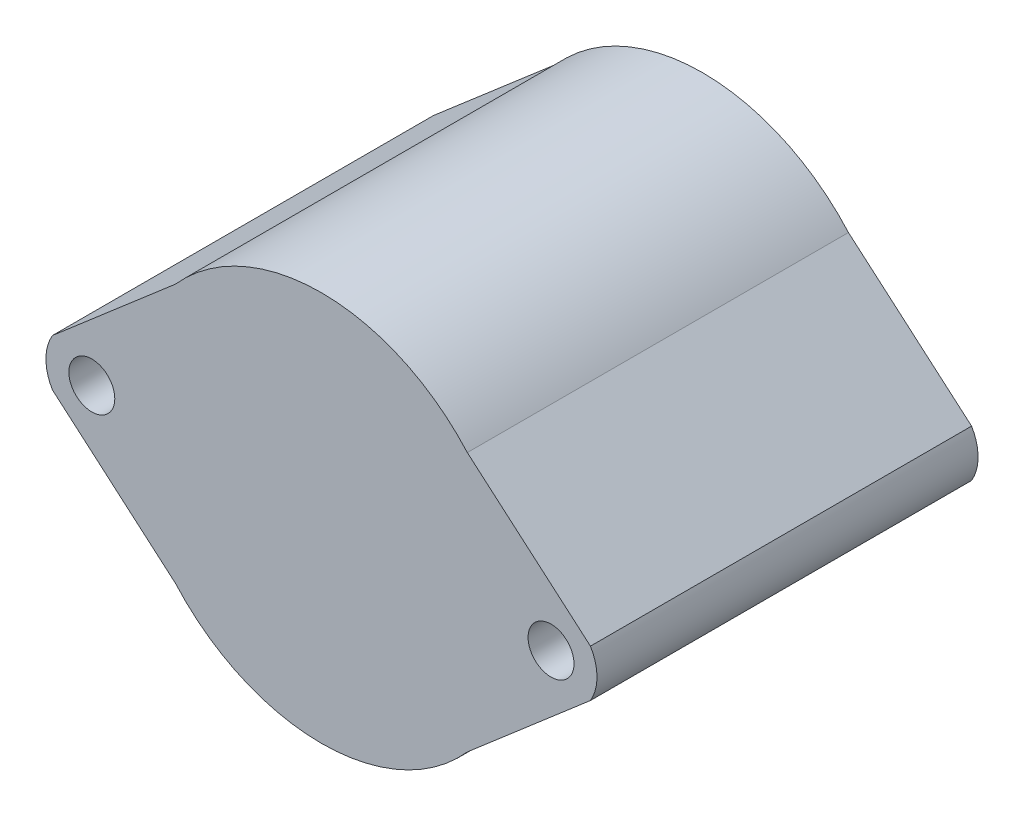
ISO-10303-21;
HEADER;
FILE_DESCRIPTION(('STEP AP214'),'2;1');
FILE_NAME('part.step','',(''),(''),'','','');
FILE_SCHEMA(('AUTOMOTIVE_DESIGN { 1 0 10303 214 1 1 1 1 }'));
ENDSEC;
DATA;
#1=APPLICATION_CONTEXT('core data for automotive mechanical design processes');
#2=APPLICATION_PROTOCOL_DEFINITION('international standard','automotive_design',2000,#1);
#3=PRODUCT_CONTEXT('',#1,'mechanical');
#4=PRODUCT('Part','Part','',(#3));
#5=PRODUCT_RELATED_PRODUCT_CATEGORY('part','',(#4));
#6=PRODUCT_DEFINITION_FORMATION('','',#4);
#7=PRODUCT_DEFINITION_CONTEXT('part definition',#1,'design');
#8=PRODUCT_DEFINITION('design','',#6,#7);
#9=PRODUCT_DEFINITION_SHAPE('','',#8);
#10=(LENGTH_UNIT() NAMED_UNIT(*) SI_UNIT(.MILLI.,.METRE.));
#11=(NAMED_UNIT(*) PLANE_ANGLE_UNIT() SI_UNIT($,.RADIAN.));
#12=(NAMED_UNIT(*) SI_UNIT($,.STERADIAN.) SOLID_ANGLE_UNIT());
#13=UNCERTAINTY_MEASURE_WITH_UNIT(LENGTH_MEASURE(1.E-05),#10,'distance_accuracy_value','');
#14=(GEOMETRIC_REPRESENTATION_CONTEXT(3) GLOBAL_UNCERTAINTY_ASSIGNED_CONTEXT((#13)) GLOBAL_UNIT_ASSIGNED_CONTEXT((#10,
#11,#12)) REPRESENTATION_CONTEXT('',''));
#15=CARTESIAN_POINT('',(0.,0.,0.));
#16=DIRECTION('',(0.,0.,1.));
#17=DIRECTION('',(1.,0.,0.));
#18=AXIS2_PLACEMENT_3D('',#15,#16,#17);
#19=CARTESIAN_POINT('',(20.,0.,33.2));
#20=DIRECTION('',(0.,0.,1.));
#21=DIRECTION('',(1.,0.,0.));
#22=AXIS2_PLACEMENT_3D('',#19,#20,#21);
#23=PLANE('',#22);
#24=CARTESIAN_POINT('',(-20.,0.,33.2));
#25=DIRECTION('',(0.,0.,1.));
#26=DIRECTION('',(1.,0.,0.));
#27=AXIS2_PLACEMENT_3D('',#24,#25,#26);
#28=CIRCLE('',#27,2.);
#29=CARTESIAN_POINT('',(-18.,0.,33.2));
#30=VERTEX_POINT('',#29);
#31=EDGE_CURVE('E134',#30,#30,#28,.T.);
#32=ORIENTED_EDGE('',*,*,#31,.F.);
#33=EDGE_LOOP('',(#32));
#34=FACE_BOUND('',#33,.T.);
#35=CARTESIAN_POINT('',(20.,0.,33.2));
#36=DIRECTION('',(0.,0.,1.));
#37=DIRECTION('',(1.,0.,0.));
#38=AXIS2_PLACEMENT_3D('',#35,#36,#37);
#39=CIRCLE('',#38,4.);
#40=CARTESIAN_POINT('',(23.433804338793,-2.05158177094813,33.2));
#41=VERTEX_POINT('',#40);
#42=CARTESIAN_POINT('',(23.433804338793,2.05158177094813,33.2));
#43=VERTEX_POINT('',#42);
#44=EDGE_CURVE('E145',#41,#43,#39,.T.);
#45=ORIENTED_EDGE('',*,*,#44,.T.);
#46=DIRECTION('',(-0.757630891805894,0.652683255324822,0.));
#47=VECTOR('',#46,1.);
#48=CARTESIAN_POINT('',(23.433804338793,2.05158177094813,33.2));
#49=LINE('',#48,#47);
#50=CARTESIAN_POINT('',(12.7089428610678,11.2908268675998,33.2));
#51=VERTEX_POINT('',#50);
#52=EDGE_CURVE('E93',#43,#51,#49,.T.);
#53=ORIENTED_EDGE('',*,*,#52,.T.);
#54=CARTESIAN_POINT('',(0.,0.,33.2));
#55=DIRECTION('',(0.,0.,1.));
#56=DIRECTION('',(1.,0.,0.));
#57=AXIS2_PLACEMENT_3D('',#54,#55,#56);
#58=CIRCLE('',#57,17.);
#59=CARTESIAN_POINT('',(-12.7089428610678,11.2908268675998,33.2));
#60=VERTEX_POINT('',#59);
#61=EDGE_CURVE('E160',#51,#60,#58,.T.);
#62=ORIENTED_EDGE('',*,*,#61,.T.);
#63=DIRECTION('',(-0.757630891805894,-0.652683255324822,0.));
#64=VECTOR('',#63,1.);
#65=CARTESIAN_POINT('',(-23.433804338793,2.05158177094813,33.2));
#66=LINE('',#65,#64);
#67=CARTESIAN_POINT('',(-23.433804338793,2.05158177094813,33.2));
#68=VERTEX_POINT('',#67);
#69=EDGE_CURVE('E173',#60,#68,#66,.T.);
#70=ORIENTED_EDGE('',*,*,#69,.T.);
#71=CARTESIAN_POINT('',(-20.,0.,33.2));
#72=DIRECTION('',(0.,0.,1.));
#73=DIRECTION('',(1.,0.,0.));
#74=AXIS2_PLACEMENT_3D('',#71,#72,#73);
#75=CIRCLE('',#74,4.);
#76=CARTESIAN_POINT('',(-23.433804338793,-2.05158177094813,33.2));
#77=VERTEX_POINT('',#76);
#78=EDGE_CURVE('E112',#68,#77,#75,.T.);
#79=ORIENTED_EDGE('',*,*,#78,.T.);
#80=DIRECTION('',(0.757630891805894,-0.652683255324822,0.));
#81=VECTOR('',#80,1.);
#82=CARTESIAN_POINT('',(-23.433804338793,-2.05158177094813,33.2));
#83=LINE('',#82,#81);
#84=CARTESIAN_POINT('',(-12.7089428610678,-11.2908268675998,33.2));
#85=VERTEX_POINT('',#84);
#86=EDGE_CURVE('E106',#77,#85,#83,.T.);
#87=ORIENTED_EDGE('',*,*,#86,.T.);
#88=CARTESIAN_POINT('',(0.,0.,33.2));
#89=DIRECTION('',(0.,0.,1.));
#90=DIRECTION('',(1.,0.,0.));
#91=AXIS2_PLACEMENT_3D('',#88,#89,#90);
#92=CIRCLE('',#91,17.);
#93=CARTESIAN_POINT('',(12.7089428610678,-11.2908268675998,33.2));
#94=VERTEX_POINT('',#93);
#95=EDGE_CURVE('E110',#85,#94,#92,.T.);
#96=ORIENTED_EDGE('',*,*,#95,.T.);
#97=DIRECTION('',(0.757630891805894,0.652683255324822,0.));
#98=VECTOR('',#97,1.);
#99=CARTESIAN_POINT('',(23.433804338793,-2.05158177094813,33.2));
#100=LINE('',#99,#98);
#101=EDGE_CURVE('E50',#94,#41,#100,.T.);
#102=ORIENTED_EDGE('',*,*,#101,.T.);
#103=EDGE_LOOP('',(#45,#53,#62,#70,#79,#87,#96,#102));
#104=FACE_BOUND('',#103,.T.);
#105=CARTESIAN_POINT('',(20.,0.,33.2));
#106=DIRECTION('',(0.,0.,1.));
#107=DIRECTION('',(1.,0.,0.));
#108=AXIS2_PLACEMENT_3D('',#105,#106,#107);
#109=CIRCLE('',#108,2.);
#110=CARTESIAN_POINT('',(22.,0.,33.2));
#111=VERTEX_POINT('',#110);
#112=EDGE_CURVE('E182',#111,#111,#109,.T.);
#113=ORIENTED_EDGE('',*,*,#112,.F.);
#114=EDGE_LOOP('',(#113));
#115=FACE_BOUND('',#114,.T.);
#116=ADVANCED_FACE('F33',(#34,#104,#115),#23,.T.);
#117=CARTESIAN_POINT('',(20.,0.,0.));
#118=DIRECTION('',(0.,0.,1.));
#119=DIRECTION('',(1.,0.,0.));
#120=AXIS2_PLACEMENT_3D('',#117,#118,#119);
#121=PLANE('',#120);
#122=CARTESIAN_POINT('',(20.,0.,0.));
#123=DIRECTION('',(0.,0.,1.));
#124=DIRECTION('',(1.,0.,0.));
#125=AXIS2_PLACEMENT_3D('',#122,#123,#124);
#126=CIRCLE('',#125,4.);
#127=CARTESIAN_POINT('',(23.433804338793,-2.05158177094813,0.));
#128=VERTEX_POINT('',#127);
#129=CARTESIAN_POINT('',(23.433804338793,2.05158177094813,0.));
#130=VERTEX_POINT('',#129);
#131=EDGE_CURVE('E130',#128,#130,#126,.T.);
#132=ORIENTED_EDGE('',*,*,#131,.F.);
#133=DIRECTION('',(0.757630891805894,0.652683255324822,0.));
#134=VECTOR('',#133,1.);
#135=CARTESIAN_POINT('',(23.433804338793,-2.05158177094813,0.));
#136=LINE('',#135,#134);
#137=CARTESIAN_POINT('',(12.7089428610678,-11.2908268675998,0.));
#138=VERTEX_POINT('',#137);
#139=EDGE_CURVE('E85',#138,#128,#136,.T.);
#140=ORIENTED_EDGE('',*,*,#139,.F.);
#141=CARTESIAN_POINT('',(0.,0.,0.));
#142=DIRECTION('',(0.,0.,1.));
#143=DIRECTION('',(1.,0.,0.));
#144=AXIS2_PLACEMENT_3D('',#141,#142,#143);
#145=CIRCLE('',#144,17.);
#146=CARTESIAN_POINT('',(-12.7089428610678,-11.2908268675998,0.));
#147=VERTEX_POINT('',#146);
#148=EDGE_CURVE('E79',#147,#138,#145,.T.);
#149=ORIENTED_EDGE('',*,*,#148,.F.);
#150=DIRECTION('',(0.757630891805894,-0.652683255324822,0.));
#151=VECTOR('',#150,1.);
#152=CARTESIAN_POINT('',(-23.433804338793,-2.05158177094813,0.));
#153=LINE('',#152,#151);
#154=CARTESIAN_POINT('',(-23.433804338793,-2.05158177094813,0.));
#155=VERTEX_POINT('',#154);
#156=EDGE_CURVE('E120',#155,#147,#153,.T.);
#157=ORIENTED_EDGE('',*,*,#156,.F.);
#158=CARTESIAN_POINT('',(-20.,0.,0.));
#159=DIRECTION('',(0.,0.,1.));
#160=DIRECTION('',(1.,0.,0.));
#161=AXIS2_PLACEMENT_3D('',#158,#159,#160);
#162=CIRCLE('',#161,4.);
#163=CARTESIAN_POINT('',(-23.433804338793,2.05158177094813,0.));
#164=VERTEX_POINT('',#163);
#165=EDGE_CURVE('E140',#164,#155,#162,.T.);
#166=ORIENTED_EDGE('',*,*,#165,.F.);
#167=DIRECTION('',(-0.757630891805894,-0.652683255324822,0.));
#168=VECTOR('',#167,1.);
#169=CARTESIAN_POINT('',(-23.433804338793,2.05158177094813,0.));
#170=LINE('',#169,#168);
#171=CARTESIAN_POINT('',(-12.7089428610678,11.2908268675998,0.));
#172=VERTEX_POINT('',#171);
#173=EDGE_CURVE('E138',#172,#164,#170,.T.);
#174=ORIENTED_EDGE('',*,*,#173,.F.);
#175=CARTESIAN_POINT('',(0.,0.,0.));
#176=DIRECTION('',(0.,0.,1.));
#177=DIRECTION('',(1.,0.,0.));
#178=AXIS2_PLACEMENT_3D('',#175,#176,#177);
#179=CIRCLE('',#178,17.);
#180=CARTESIAN_POINT('',(12.7089428610678,11.2908268675998,0.));
#181=VERTEX_POINT('',#180);
#182=EDGE_CURVE('E136',#181,#172,#179,.T.);
#183=ORIENTED_EDGE('',*,*,#182,.F.);
#184=DIRECTION('',(-0.757630891805894,0.652683255324822,0.));
#185=VECTOR('',#184,1.);
#186=CARTESIAN_POINT('',(23.433804338793,2.05158177094813,0.));
#187=LINE('',#186,#185);
#188=EDGE_CURVE('E133',#130,#181,#187,.T.);
#189=ORIENTED_EDGE('',*,*,#188,.F.);
#190=EDGE_LOOP('',(#132,#140,#149,#157,#166,#174,#183,#189));
#191=FACE_BOUND('',#190,.T.);
#192=CARTESIAN_POINT('',(-20.,0.,0.));
#193=DIRECTION('',(0.,0.,1.));
#194=DIRECTION('',(1.,0.,0.));
#195=AXIS2_PLACEMENT_3D('',#192,#193,#194);
#196=CIRCLE('',#195,2.);
#197=CARTESIAN_POINT('',(-18.,0.,0.));
#198=VERTEX_POINT('',#197);
#199=EDGE_CURVE('E179',#198,#198,#196,.T.);
#200=ORIENTED_EDGE('',*,*,#199,.T.);
#201=EDGE_LOOP('',(#200));
#202=FACE_BOUND('',#201,.T.);
#203=CARTESIAN_POINT('',(20.,0.,0.));
#204=DIRECTION('',(0.,0.,1.));
#205=DIRECTION('',(1.,0.,0.));
#206=AXIS2_PLACEMENT_3D('',#203,#204,#205);
#207=CIRCLE('',#206,2.);
#208=CARTESIAN_POINT('',(22.,0.,0.));
#209=VERTEX_POINT('',#208);
#210=EDGE_CURVE('E185',#209,#209,#207,.T.);
#211=ORIENTED_EDGE('',*,*,#210,.T.);
#212=EDGE_LOOP('',(#211));
#213=FACE_BOUND('',#212,.T.);
#214=ADVANCED_FACE('F164',(#191,#202,#213),#121,.F.);
#215=CARTESIAN_POINT('',(20.,0.,33.2));
#216=DIRECTION('',(0.,0.,-1.));
#217=DIRECTION('',(-1.,0.,0.));
#218=AXIS2_PLACEMENT_3D('',#215,#216,#217);
#219=CYLINDRICAL_SURFACE('',#218,4.);
#220=ORIENTED_EDGE('',*,*,#131,.T.);
#221=DIRECTION('',(0.,0.,-1.));
#222=VECTOR('',#221,1.);
#223=CARTESIAN_POINT('',(23.433804338793,2.05158177094813,33.2));
#224=LINE('',#223,#222);
#225=EDGE_CURVE('E11',#43,#130,#224,.T.);
#226=ORIENTED_EDGE('',*,*,#225,.F.);
#227=ORIENTED_EDGE('',*,*,#44,.F.);
#228=DIRECTION('',(0.,0.,-1.));
#229=VECTOR('',#228,1.);
#230=CARTESIAN_POINT('',(23.433804338793,-2.05158177094813,33.2));
#231=LINE('',#230,#229);
#232=EDGE_CURVE('E126',#41,#128,#231,.T.);
#233=ORIENTED_EDGE('',*,*,#232,.T.);
#234=EDGE_LOOP('',(#220,#226,#227,#233));
#235=FACE_BOUND('',#234,.T.);
#236=ADVANCED_FACE('F35',(#235),#219,.T.);
#237=CARTESIAN_POINT('',(23.433804338793,2.05158177094813,33.2));
#238=DIRECTION('',(-0.652683255324821,-0.757630891805894,0.));
#239=DIRECTION('',(0.757630891805894,-0.652683255324822,0.));
#240=AXIS2_PLACEMENT_3D('',#237,#238,#239);
#241=PLANE('',#240);
#242=ORIENTED_EDGE('',*,*,#188,.T.);
#243=DIRECTION('',(0.,0.,-1.));
#244=VECTOR('',#243,1.);
#245=CARTESIAN_POINT('',(12.7089428610678,11.2908268675998,33.2));
#246=LINE('',#245,#244);
#247=EDGE_CURVE('E42',#51,#181,#246,.T.);
#248=ORIENTED_EDGE('',*,*,#247,.F.);
#249=ORIENTED_EDGE('',*,*,#52,.F.);
#250=ORIENTED_EDGE('',*,*,#225,.T.);
#251=EDGE_LOOP('',(#242,#248,#249,#250));
#252=FACE_BOUND('',#251,.T.);
#253=ADVANCED_FACE('F217',(#252),#241,.F.);
#254=CARTESIAN_POINT('',(0.,0.,33.2));
#255=DIRECTION('',(0.,0.,-1.));
#256=DIRECTION('',(-1.,0.,0.));
#257=AXIS2_PLACEMENT_3D('',#254,#255,#256);
#258=CYLINDRICAL_SURFACE('',#257,17.);
#259=ORIENTED_EDGE('',*,*,#182,.T.);
#260=DIRECTION('',(0.,0.,-1.));
#261=VECTOR('',#260,1.);
#262=CARTESIAN_POINT('',(-12.7089428610678,11.2908268675998,33.2));
#263=LINE('',#262,#261);
#264=EDGE_CURVE('E152',#60,#172,#263,.T.);
#265=ORIENTED_EDGE('',*,*,#264,.F.);
#266=ORIENTED_EDGE('',*,*,#61,.F.);
#267=ORIENTED_EDGE('',*,*,#247,.T.);
#268=EDGE_LOOP('',(#259,#265,#266,#267));
#269=FACE_BOUND('',#268,.T.);
#270=ADVANCED_FACE('F158',(#269),#258,.T.);
#271=CARTESIAN_POINT('',(-23.433804338793,2.05158177094813,33.2));
#272=DIRECTION('',(0.652683255324821,-0.757630891805894,0.));
#273=DIRECTION('',(0.757630891805894,0.652683255324822,0.));
#274=AXIS2_PLACEMENT_3D('',#271,#272,#273);
#275=PLANE('',#274);
#276=ORIENTED_EDGE('',*,*,#173,.T.);
#277=DIRECTION('',(0.,0.,-1.));
#278=VECTOR('',#277,1.);
#279=CARTESIAN_POINT('',(-23.433804338793,2.05158177094813,33.2));
#280=LINE('',#279,#278);
#281=EDGE_CURVE('E149',#68,#164,#280,.T.);
#282=ORIENTED_EDGE('',*,*,#281,.F.);
#283=ORIENTED_EDGE('',*,*,#69,.F.);
#284=ORIENTED_EDGE('',*,*,#264,.T.);
#285=EDGE_LOOP('',(#276,#282,#283,#284));
#286=FACE_BOUND('',#285,.T.);
#287=ADVANCED_FACE('F169',(#286),#275,.F.);
#288=CARTESIAN_POINT('',(-20.,0.,33.2));
#289=DIRECTION('',(0.,0.,-1.));
#290=DIRECTION('',(-1.,0.,0.));
#291=AXIS2_PLACEMENT_3D('',#288,#289,#290);
#292=CYLINDRICAL_SURFACE('',#291,4.);
#293=ORIENTED_EDGE('',*,*,#165,.T.);
#294=DIRECTION('',(0.,0.,-1.));
#295=VECTOR('',#294,1.);
#296=CARTESIAN_POINT('',(-23.433804338793,-2.05158177094813,33.2));
#297=LINE('',#296,#295);
#298=EDGE_CURVE('E121',#77,#155,#297,.T.);
#299=ORIENTED_EDGE('',*,*,#298,.F.);
#300=ORIENTED_EDGE('',*,*,#78,.F.);
#301=ORIENTED_EDGE('',*,*,#281,.T.);
#302=EDGE_LOOP('',(#293,#299,#300,#301));
#303=FACE_BOUND('',#302,.T.);
#304=ADVANCED_FACE('F172',(#303),#292,.T.);
#305=CARTESIAN_POINT('',(-23.433804338793,-2.05158177094813,33.2));
#306=DIRECTION('',(0.652683255324821,0.757630891805894,0.));
#307=DIRECTION('',(-0.757630891805894,0.652683255324822,0.));
#308=AXIS2_PLACEMENT_3D('',#305,#306,#307);
#309=PLANE('',#308);
#310=ORIENTED_EDGE('',*,*,#156,.T.);
#311=DIRECTION('',(0.,0.,-1.));
#312=VECTOR('',#311,1.);
#313=CARTESIAN_POINT('',(-12.7089428610678,-11.2908268675998,33.2));
#314=LINE('',#313,#312);
#315=EDGE_CURVE('E117',#85,#147,#314,.T.);
#316=ORIENTED_EDGE('',*,*,#315,.F.);
#317=ORIENTED_EDGE('',*,*,#86,.F.);
#318=ORIENTED_EDGE('',*,*,#298,.T.);
#319=EDGE_LOOP('',(#310,#316,#317,#318));
#320=FACE_BOUND('',#319,.T.);
#321=ADVANCED_FACE('F118',(#320),#309,.F.);
#322=CARTESIAN_POINT('',(0.,0.,33.2));
#323=DIRECTION('',(0.,0.,-1.));
#324=DIRECTION('',(-1.,0.,0.));
#325=AXIS2_PLACEMENT_3D('',#322,#323,#324);
#326=CYLINDRICAL_SURFACE('',#325,17.);
#327=ORIENTED_EDGE('',*,*,#148,.T.);
#328=DIRECTION('',(0.,0.,-1.));
#329=VECTOR('',#328,1.);
#330=CARTESIAN_POINT('',(12.7089428610678,-11.2908268675998,33.2));
#331=LINE('',#330,#329);
#332=EDGE_CURVE('E122',#94,#138,#331,.T.);
#333=ORIENTED_EDGE('',*,*,#332,.F.);
#334=ORIENTED_EDGE('',*,*,#95,.F.);
#335=ORIENTED_EDGE('',*,*,#315,.T.);
#336=EDGE_LOOP('',(#327,#333,#334,#335));
#337=FACE_BOUND('',#336,.T.);
#338=ADVANCED_FACE('F124',(#337),#326,.T.);
#339=CARTESIAN_POINT('',(23.433804338793,-2.05158177094813,33.2));
#340=DIRECTION('',(-0.652683255324821,0.757630891805894,0.));
#341=DIRECTION('',(-0.757630891805894,-0.652683255324822,0.));
#342=AXIS2_PLACEMENT_3D('',#339,#340,#341);
#343=PLANE('',#342);
#344=ORIENTED_EDGE('',*,*,#139,.T.);
#345=ORIENTED_EDGE('',*,*,#232,.F.);
#346=ORIENTED_EDGE('',*,*,#101,.F.);
#347=ORIENTED_EDGE('',*,*,#332,.T.);
#348=EDGE_LOOP('',(#344,#345,#346,#347));
#349=FACE_BOUND('',#348,.T.);
#350=ADVANCED_FACE('F205',(#349),#343,.F.);
#351=CARTESIAN_POINT('',(-20.,0.,33.2));
#352=DIRECTION('',(0.,0.,-1.));
#353=DIRECTION('',(-1.,0.,0.));
#354=AXIS2_PLACEMENT_3D('',#351,#352,#353);
#355=CYLINDRICAL_SURFACE('',#354,2.);
#356=ORIENTED_EDGE('',*,*,#31,.T.);
#357=EDGE_LOOP('',(#356));
#358=FACE_BOUND('',#357,.T.);
#359=ORIENTED_EDGE('',*,*,#199,.F.);
#360=EDGE_LOOP('',(#359));
#361=FACE_BOUND('',#360,.T.);
#362=ADVANCED_FACE('F202',(#358,#361),#355,.F.);
#363=CARTESIAN_POINT('',(20.,0.,33.2));
#364=DIRECTION('',(0.,0.,-1.));
#365=DIRECTION('',(-1.,0.,0.));
#366=AXIS2_PLACEMENT_3D('',#363,#364,#365);
#367=CYLINDRICAL_SURFACE('',#366,2.);
#368=ORIENTED_EDGE('',*,*,#112,.T.);
#369=EDGE_LOOP('',(#368));
#370=FACE_BOUND('',#369,.T.);
#371=ORIENTED_EDGE('',*,*,#210,.F.);
#372=EDGE_LOOP('',(#371));
#373=FACE_BOUND('',#372,.T.);
#374=ADVANCED_FACE('F191',(#370,#373),#367,.F.);
#375=CLOSED_SHELL('',(#116,#214,#236,#253,#270,#287,#304,#321,#338,#350,#362,#374));
#376=MANIFOLD_SOLID_BREP('B2',#375);
#377=ADVANCED_BREP_SHAPE_REPRESENTATION('',(#18,#376),#14);
#378=SHAPE_DEFINITION_REPRESENTATION(#9,#377);
ENDSEC;
END-ISO-10303-21;
